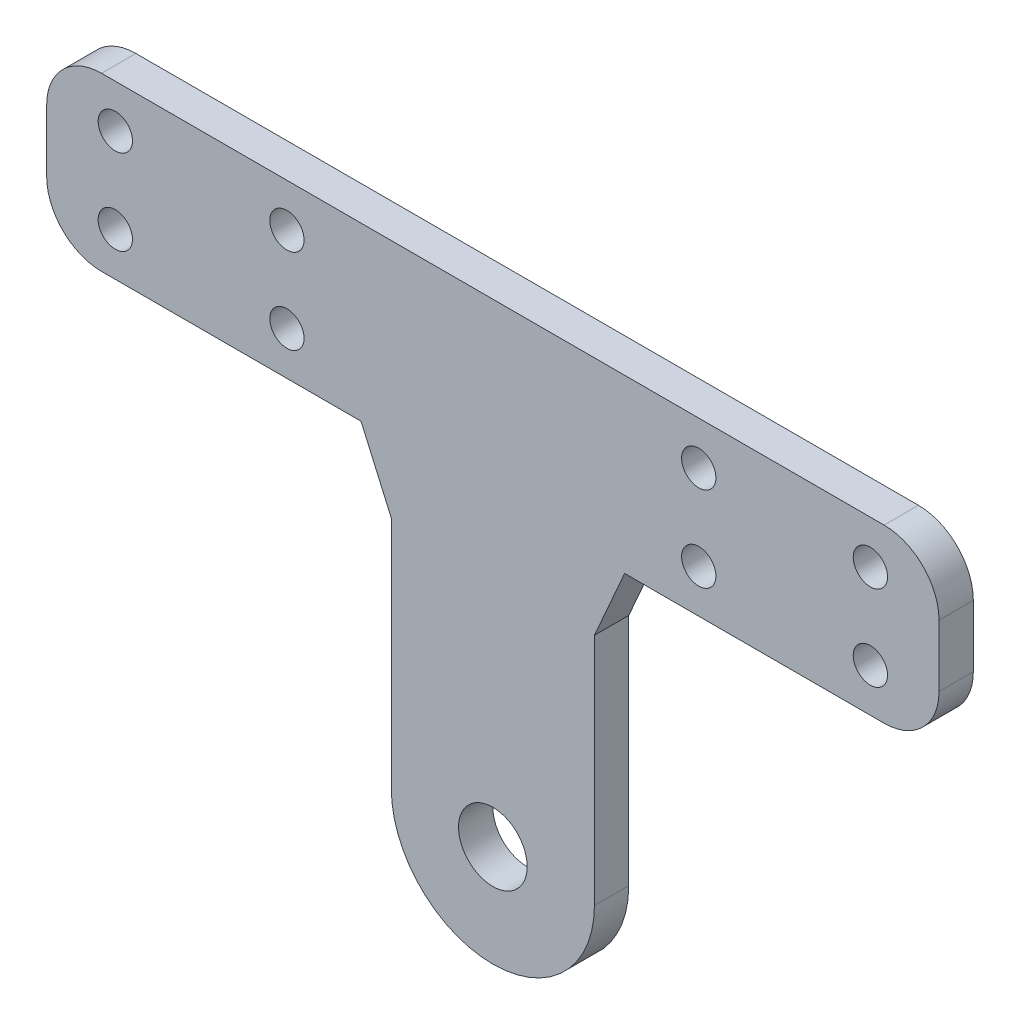
ISO-10303-21;
HEADER;
FILE_DESCRIPTION(('STEP AP214'),'2;1');
FILE_NAME('part.step','',(''),(''),'','','');
FILE_SCHEMA(('AUTOMOTIVE_DESIGN { 1 0 10303 214 1 1 1 1 }'));
ENDSEC;
DATA;
#1=APPLICATION_CONTEXT('core data for automotive mechanical design processes');
#2=APPLICATION_PROTOCOL_DEFINITION('international standard','automotive_design',2000,#1);
#3=PRODUCT_CONTEXT('',#1,'mechanical');
#4=PRODUCT('Part','Part','',(#3));
#5=PRODUCT_RELATED_PRODUCT_CATEGORY('part','',(#4));
#6=PRODUCT_DEFINITION_FORMATION('','',#4);
#7=PRODUCT_DEFINITION_CONTEXT('part definition',#1,'design');
#8=PRODUCT_DEFINITION('design','',#6,#7);
#9=PRODUCT_DEFINITION_SHAPE('','',#8);
#10=(LENGTH_UNIT() NAMED_UNIT(*) SI_UNIT(.MILLI.,.METRE.));
#11=(NAMED_UNIT(*) PLANE_ANGLE_UNIT() SI_UNIT($,.RADIAN.));
#12=(NAMED_UNIT(*) SI_UNIT($,.STERADIAN.) SOLID_ANGLE_UNIT());
#13=UNCERTAINTY_MEASURE_WITH_UNIT(LENGTH_MEASURE(1.E-05),#10,'distance_accuracy_value','');
#14=(GEOMETRIC_REPRESENTATION_CONTEXT(3) GLOBAL_UNCERTAINTY_ASSIGNED_CONTEXT((#13)) GLOBAL_UNIT_ASSIGNED_CONTEXT((#10,
#11,#12)) REPRESENTATION_CONTEXT('',''));
#15=CARTESIAN_POINT('',(0.,0.,0.));
#16=DIRECTION('',(0.,0.,1.));
#17=DIRECTION('',(1.,0.,0.));
#18=AXIS2_PLACEMENT_3D('',#15,#16,#17);
#19=CARTESIAN_POINT('',(0.,0.,3.175));
#20=DIRECTION('',(0.,0.,1.));
#21=DIRECTION('',(1.,0.,0.));
#22=AXIS2_PLACEMENT_3D('',#19,#20,#21);
#23=PLANE('',#22);
#24=CARTESIAN_POINT('',(-34.925,39.879,3.175));
#25=DIRECTION('',(0.,0.,1.));
#26=DIRECTION('',(1.,0.,0.));
#27=AXIS2_PLACEMENT_3D('',#24,#25,#26);
#28=CIRCLE('',#27,1.5875);
#29=CARTESIAN_POINT('',(-33.3375,39.879,3.175));
#30=VERTEX_POINT('',#29);
#31=EDGE_CURVE('E295',#30,#30,#28,.T.);
#32=ORIENTED_EDGE('',*,*,#31,.F.);
#33=EDGE_LOOP('',(#32));
#34=FACE_BOUND('',#33,.T.);
#35=CARTESIAN_POINT('',(-19.05,39.879,3.175));
#36=DIRECTION('',(0.,0.,1.));
#37=DIRECTION('',(1.,0.,0.));
#38=AXIS2_PLACEMENT_3D('',#35,#36,#37);
#39=CIRCLE('',#38,1.5875);
#40=CARTESIAN_POINT('',(-17.4625,39.879,3.175));
#41=VERTEX_POINT('',#40);
#42=EDGE_CURVE('E283',#41,#41,#39,.T.);
#43=ORIENTED_EDGE('',*,*,#42,.F.);
#44=EDGE_LOOP('',(#43));
#45=FACE_BOUND('',#44,.T.);
#46=CARTESIAN_POINT('',(34.925,32.004,3.175));
#47=DIRECTION('',(0.,0.,1.));
#48=DIRECTION('',(-1.,0.,0.));
#49=AXIS2_PLACEMENT_3D('',#46,#47,#48);
#50=CIRCLE('',#49,1.5875);
#51=CARTESIAN_POINT('',(33.3375,32.004,3.175));
#52=VERTEX_POINT('',#51);
#53=EDGE_CURVE('E271',#52,#52,#50,.T.);
#54=ORIENTED_EDGE('',*,*,#53,.F.);
#55=EDGE_LOOP('',(#54));
#56=FACE_BOUND('',#55,.T.);
#57=CARTESIAN_POINT('',(-19.05,32.004,3.175));
#58=DIRECTION('',(0.,0.,1.));
#59=DIRECTION('',(1.,0.,0.));
#60=AXIS2_PLACEMENT_3D('',#57,#58,#59);
#61=CIRCLE('',#60,1.5875);
#62=CARTESIAN_POINT('',(-17.4625,32.004,3.175));
#63=VERTEX_POINT('',#62);
#64=EDGE_CURVE('E259',#63,#63,#61,.T.);
#65=ORIENTED_EDGE('',*,*,#64,.F.);
#66=EDGE_LOOP('',(#65));
#67=FACE_BOUND('',#66,.T.);
#68=DIRECTION('',(1.,0.,0.));
#69=VECTOR('',#68,1.);
#70=CARTESIAN_POINT('',(12.192,28.004,3.175));
#71=LINE('',#70,#69);
#72=CARTESIAN_POINT('',(12.192,28.004,3.175));
#73=VERTEX_POINT('',#72);
#74=CARTESIAN_POINT('',(36.195,28.004,3.175));
#75=VERTEX_POINT('',#74);
#76=EDGE_CURVE('E172',#73,#75,#71,.T.);
#77=ORIENTED_EDGE('',*,*,#76,.T.);
#78=CARTESIAN_POINT('',(36.195,33.084,3.175));
#79=DIRECTION('',(0.,0.,1.));
#80=DIRECTION('',(1.,0.,0.));
#81=AXIS2_PLACEMENT_3D('',#78,#79,#80);
#82=CIRCLE('',#81,5.08);
#83=CARTESIAN_POINT('',(41.275,33.084,3.175));
#84=VERTEX_POINT('',#83);
#85=EDGE_CURVE('E232',#75,#84,#82,.T.);
#86=ORIENTED_EDGE('',*,*,#85,.T.);
#87=DIRECTION('',(0.,1.,0.));
#88=VECTOR('',#87,1.);
#89=CARTESIAN_POINT('',(41.275,43.879,3.175));
#90=LINE('',#89,#88);
#91=CARTESIAN_POINT('',(41.275,38.799,3.175));
#92=VERTEX_POINT('',#91);
#93=EDGE_CURVE('E174',#84,#92,#90,.T.);
#94=ORIENTED_EDGE('',*,*,#93,.T.);
#95=CARTESIAN_POINT('',(36.195,38.799,3.175));
#96=DIRECTION('',(0.,0.,1.));
#97=DIRECTION('',(1.,0.,0.));
#98=AXIS2_PLACEMENT_3D('',#95,#96,#97);
#99=CIRCLE('',#98,5.08);
#100=CARTESIAN_POINT('',(36.195,43.879,3.175));
#101=VERTEX_POINT('',#100);
#102=EDGE_CURVE('E55',#92,#101,#99,.T.);
#103=ORIENTED_EDGE('',*,*,#102,.T.);
#104=DIRECTION('',(-1.,0.,0.));
#105=VECTOR('',#104,1.);
#106=CARTESIAN_POINT('',(-41.275,43.879,3.175));
#107=LINE('',#106,#105);
#108=CARTESIAN_POINT('',(-36.195,43.879,3.175));
#109=VERTEX_POINT('',#108);
#110=EDGE_CURVE('E176',#101,#109,#107,.T.);
#111=ORIENTED_EDGE('',*,*,#110,.T.);
#112=CARTESIAN_POINT('',(-36.195,38.799,3.175));
#113=DIRECTION('',(0.,0.,1.));
#114=DIRECTION('',(1.,0.,0.));
#115=AXIS2_PLACEMENT_3D('',#112,#113,#114);
#116=CIRCLE('',#115,5.08);
#117=CARTESIAN_POINT('',(-41.275,38.799,3.175));
#118=VERTEX_POINT('',#117);
#119=EDGE_CURVE('E228',#109,#118,#116,.T.);
#120=ORIENTED_EDGE('',*,*,#119,.T.);
#121=DIRECTION('',(0.,-1.,0.));
#122=VECTOR('',#121,1.);
#123=CARTESIAN_POINT('',(-41.275,43.879,3.175));
#124=LINE('',#123,#122);
#125=CARTESIAN_POINT('',(-41.275,33.084,3.175));
#126=VERTEX_POINT('',#125);
#127=EDGE_CURVE('E146',#118,#126,#124,.T.);
#128=ORIENTED_EDGE('',*,*,#127,.T.);
#129=CARTESIAN_POINT('',(-36.195,33.084,3.175));
#130=DIRECTION('',(0.,0.,1.));
#131=DIRECTION('',(1.,0.,0.));
#132=AXIS2_PLACEMENT_3D('',#129,#130,#131);
#133=CIRCLE('',#132,5.08);
#134=CARTESIAN_POINT('',(-36.195,28.004,3.175));
#135=VERTEX_POINT('',#134);
#136=EDGE_CURVE('E142',#126,#135,#133,.T.);
#137=ORIENTED_EDGE('',*,*,#136,.T.);
#138=DIRECTION('',(1.,0.,0.));
#139=VECTOR('',#138,1.);
#140=CARTESIAN_POINT('',(-41.275,28.004,3.175));
#141=LINE('',#140,#139);
#142=CARTESIAN_POINT('',(-12.192,28.004,3.175));
#143=VERTEX_POINT('',#142);
#144=EDGE_CURVE('E133',#135,#143,#141,.T.);
#145=ORIENTED_EDGE('',*,*,#144,.T.);
#146=DIRECTION('',(0.402738614266017,-0.915315032422766,0.));
#147=VECTOR('',#146,1.);
#148=CARTESIAN_POINT('',(-12.192,28.004,3.175));
#149=LINE('',#148,#147);
#150=CARTESIAN_POINT('',(-9.398,21.654,3.175));
#151=VERTEX_POINT('',#150);
#152=EDGE_CURVE('E138',#143,#151,#149,.T.);
#153=ORIENTED_EDGE('',*,*,#152,.T.);
#154=DIRECTION('',(0.,-1.,0.));
#155=VECTOR('',#154,1.);
#156=CARTESIAN_POINT('',(-9.398,21.654,3.175));
#157=LINE('',#156,#155);
#158=CARTESIAN_POINT('',(-9.398,0.,3.175));
#159=VERTEX_POINT('',#158);
#160=EDGE_CURVE('E161',#151,#159,#157,.T.);
#161=ORIENTED_EDGE('',*,*,#160,.T.);
#162=CARTESIAN_POINT('',(0.,0.,3.175));
#163=DIRECTION('',(0.,0.,1.));
#164=DIRECTION('',(1.,0.,0.));
#165=AXIS2_PLACEMENT_3D('',#162,#163,#164);
#166=CIRCLE('',#165,9.398);
#167=CARTESIAN_POINT('',(9.398,0.,3.175));
#168=VERTEX_POINT('',#167);
#169=EDGE_CURVE('E163',#159,#168,#166,.T.);
#170=ORIENTED_EDGE('',*,*,#169,.T.);
#171=DIRECTION('',(0.,1.,0.));
#172=VECTOR('',#171,1.);
#173=CARTESIAN_POINT('',(9.398,0.,3.175));
#174=LINE('',#173,#172);
#175=CARTESIAN_POINT('',(9.398,21.654,3.175));
#176=VERTEX_POINT('',#175);
#177=EDGE_CURVE('E168',#168,#176,#174,.T.);
#178=ORIENTED_EDGE('',*,*,#177,.T.);
#179=DIRECTION('',(0.402738614266017,0.915315032422765,0.));
#180=VECTOR('',#179,1.);
#181=CARTESIAN_POINT('',(9.398,21.654,3.175));
#182=LINE('',#181,#180);
#183=EDGE_CURVE('E170',#176,#73,#182,.T.);
#184=ORIENTED_EDGE('',*,*,#183,.T.);
#185=EDGE_LOOP('',(#77,#86,#94,#103,#111,#120,#128,#137,#145,#153,#161,#170,#178,#184));
#186=FACE_BOUND('',#185,.T.);
#187=CARTESIAN_POINT('',(0.,0.,3.175));
#188=DIRECTION('',(0.,0.,1.));
#189=DIRECTION('',(1.,0.,0.));
#190=AXIS2_PLACEMENT_3D('',#187,#188,#189);
#191=CIRCLE('',#190,3.175);
#192=CARTESIAN_POINT('',(3.175,0.,3.175));
#193=VERTEX_POINT('',#192);
#194=EDGE_CURVE('E182',#193,#193,#191,.T.);
#195=ORIENTED_EDGE('',*,*,#194,.F.);
#196=EDGE_LOOP('',(#195));
#197=FACE_BOUND('',#196,.T.);
#198=CARTESIAN_POINT('',(-34.925,32.004,3.175));
#199=DIRECTION('',(0.,0.,1.));
#200=DIRECTION('',(1.,0.,0.));
#201=AXIS2_PLACEMENT_3D('',#198,#199,#200);
#202=CIRCLE('',#201,1.5875);
#203=CARTESIAN_POINT('',(-33.3375,32.004,3.175));
#204=VERTEX_POINT('',#203);
#205=EDGE_CURVE('E265',#204,#204,#202,.T.);
#206=ORIENTED_EDGE('',*,*,#205,.F.);
#207=EDGE_LOOP('',(#206));
#208=FACE_BOUND('',#207,.T.);
#209=CARTESIAN_POINT('',(19.05,32.004,3.175));
#210=DIRECTION('',(0.,0.,1.));
#211=DIRECTION('',(-1.,0.,0.));
#212=AXIS2_PLACEMENT_3D('',#209,#210,#211);
#213=CIRCLE('',#212,1.5875);
#214=CARTESIAN_POINT('',(17.4625,32.004,3.175));
#215=VERTEX_POINT('',#214);
#216=EDGE_CURVE('E277',#215,#215,#213,.T.);
#217=ORIENTED_EDGE('',*,*,#216,.F.);
#218=EDGE_LOOP('',(#217));
#219=FACE_BOUND('',#218,.T.);
#220=CARTESIAN_POINT('',(34.925,39.879,3.175));
#221=DIRECTION('',(0.,0.,1.));
#222=DIRECTION('',(-1.,0.,0.));
#223=AXIS2_PLACEMENT_3D('',#220,#221,#222);
#224=CIRCLE('',#223,1.5875);
#225=CARTESIAN_POINT('',(33.3375,39.879,3.175));
#226=VERTEX_POINT('',#225);
#227=EDGE_CURVE('E289',#226,#226,#224,.T.);
#228=ORIENTED_EDGE('',*,*,#227,.F.);
#229=EDGE_LOOP('',(#228));
#230=FACE_BOUND('',#229,.T.);
#231=CARTESIAN_POINT('',(19.05,39.879,3.175));
#232=DIRECTION('',(0.,0.,1.));
#233=DIRECTION('',(-1.,0.,0.));
#234=AXIS2_PLACEMENT_3D('',#231,#232,#233);
#235=CIRCLE('',#234,1.5875);
#236=CARTESIAN_POINT('',(17.4625,39.879,3.175));
#237=VERTEX_POINT('',#236);
#238=EDGE_CURVE('E301',#237,#237,#235,.T.);
#239=ORIENTED_EDGE('',*,*,#238,.F.);
#240=EDGE_LOOP('',(#239));
#241=FACE_BOUND('',#240,.T.);
#242=ADVANCED_FACE('F33',(#34,#45,#56,#67,#186,#197,#208,#219,#230,#241),#23,.T.);
#243=CARTESIAN_POINT('',(0.,0.,0.));
#244=DIRECTION('',(0.,0.,1.));
#245=DIRECTION('',(1.,0.,0.));
#246=AXIS2_PLACEMENT_3D('',#243,#244,#245);
#247=PLANE('',#246);
#248=DIRECTION('',(0.,1.,0.));
#249=VECTOR('',#248,1.);
#250=CARTESIAN_POINT('',(41.275,43.879,0.));
#251=LINE('',#250,#249);
#252=CARTESIAN_POINT('',(41.275,33.084,0.));
#253=VERTEX_POINT('',#252);
#254=CARTESIAN_POINT('',(41.275,38.799,0.));
#255=VERTEX_POINT('',#254);
#256=EDGE_CURVE('E197',#253,#255,#251,.T.);
#257=ORIENTED_EDGE('',*,*,#256,.F.);
#258=CARTESIAN_POINT('',(36.195,33.084,0.));
#259=DIRECTION('',(0.,0.,1.));
#260=DIRECTION('',(1.,0.,0.));
#261=AXIS2_PLACEMENT_3D('',#258,#259,#260);
#262=CIRCLE('',#261,5.08);
#263=CARTESIAN_POINT('',(36.195,28.004,0.));
#264=VERTEX_POINT('',#263);
#265=EDGE_CURVE('E224',#253,#264,#262,.F.);
#266=ORIENTED_EDGE('',*,*,#265,.T.);
#267=DIRECTION('',(1.,0.,0.));
#268=VECTOR('',#267,1.);
#269=CARTESIAN_POINT('',(12.192,28.004,0.));
#270=LINE('',#269,#268);
#271=CARTESIAN_POINT('',(12.192,28.004,0.));
#272=VERTEX_POINT('',#271);
#273=EDGE_CURVE('E194',#272,#264,#270,.T.);
#274=ORIENTED_EDGE('',*,*,#273,.F.);
#275=DIRECTION('',(0.402738614266017,0.915315032422765,0.));
#276=VECTOR('',#275,1.);
#277=CARTESIAN_POINT('',(9.398,21.654,0.));
#278=LINE('',#277,#276);
#279=CARTESIAN_POINT('',(9.398,21.654,0.));
#280=VERTEX_POINT('',#279);
#281=EDGE_CURVE('E192',#280,#272,#278,.T.);
#282=ORIENTED_EDGE('',*,*,#281,.F.);
#283=DIRECTION('',(0.,1.,0.));
#284=VECTOR('',#283,1.);
#285=CARTESIAN_POINT('',(9.398,0.,0.));
#286=LINE('',#285,#284);
#287=CARTESIAN_POINT('',(9.398,0.,0.));
#288=VERTEX_POINT('',#287);
#289=EDGE_CURVE('E190',#288,#280,#286,.T.);
#290=ORIENTED_EDGE('',*,*,#289,.F.);
#291=CARTESIAN_POINT('',(0.,0.,0.));
#292=DIRECTION('',(0.,0.,1.));
#293=DIRECTION('',(1.,0.,0.));
#294=AXIS2_PLACEMENT_3D('',#291,#292,#293);
#295=CIRCLE('',#294,9.398);
#296=CARTESIAN_POINT('',(-9.398,0.,0.));
#297=VERTEX_POINT('',#296);
#298=EDGE_CURVE('E188',#297,#288,#295,.T.);
#299=ORIENTED_EDGE('',*,*,#298,.F.);
#300=DIRECTION('',(0.,-1.,0.));
#301=VECTOR('',#300,1.);
#302=CARTESIAN_POINT('',(-9.398,21.654,0.));
#303=LINE('',#302,#301);
#304=CARTESIAN_POINT('',(-9.398,21.654,0.));
#305=VERTEX_POINT('',#304);
#306=EDGE_CURVE('E186',#305,#297,#303,.T.);
#307=ORIENTED_EDGE('',*,*,#306,.F.);
#308=DIRECTION('',(0.402738614266017,-0.915315032422766,0.));
#309=VECTOR('',#308,1.);
#310=CARTESIAN_POINT('',(-12.192,28.004,0.));
#311=LINE('',#310,#309);
#312=CARTESIAN_POINT('',(-12.192,28.004,0.));
#313=VERTEX_POINT('',#312);
#314=EDGE_CURVE('E184',#313,#305,#311,.T.);
#315=ORIENTED_EDGE('',*,*,#314,.F.);
#316=DIRECTION('',(1.,0.,0.));
#317=VECTOR('',#316,1.);
#318=CARTESIAN_POINT('',(-41.275,28.004,0.));
#319=LINE('',#318,#317);
#320=CARTESIAN_POINT('',(-36.195,28.004,0.));
#321=VERTEX_POINT('',#320);
#322=EDGE_CURVE('E152',#321,#313,#319,.T.);
#323=ORIENTED_EDGE('',*,*,#322,.F.);
#324=CARTESIAN_POINT('',(-36.195,33.084,0.));
#325=DIRECTION('',(0.,0.,1.));
#326=DIRECTION('',(1.,0.,0.));
#327=AXIS2_PLACEMENT_3D('',#324,#325,#326);
#328=CIRCLE('',#327,5.08);
#329=CARTESIAN_POINT('',(-41.275,33.084,0.));
#330=VERTEX_POINT('',#329);
#331=EDGE_CURVE('E220',#321,#330,#328,.F.);
#332=ORIENTED_EDGE('',*,*,#331,.T.);
#333=DIRECTION('',(0.,-1.,0.));
#334=VECTOR('',#333,1.);
#335=CARTESIAN_POINT('',(-41.275,43.879,0.));
#336=LINE('',#335,#334);
#337=CARTESIAN_POINT('',(-41.275,38.799,0.));
#338=VERTEX_POINT('',#337);
#339=EDGE_CURVE('E179',#338,#330,#336,.T.);
#340=ORIENTED_EDGE('',*,*,#339,.F.);
#341=CARTESIAN_POINT('',(-36.195,38.799,0.));
#342=DIRECTION('',(0.,0.,1.));
#343=DIRECTION('',(1.,0.,0.));
#344=AXIS2_PLACEMENT_3D('',#341,#342,#343);
#345=CIRCLE('',#344,5.08);
#346=CARTESIAN_POINT('',(-36.195,43.879,0.));
#347=VERTEX_POINT('',#346);
#348=EDGE_CURVE('E218',#338,#347,#345,.F.);
#349=ORIENTED_EDGE('',*,*,#348,.T.);
#350=DIRECTION('',(-1.,0.,0.));
#351=VECTOR('',#350,1.);
#352=CARTESIAN_POINT('',(-41.275,43.879,0.));
#353=LINE('',#352,#351);
#354=CARTESIAN_POINT('',(36.195,43.879,0.));
#355=VERTEX_POINT('',#354);
#356=EDGE_CURVE('E200',#355,#347,#353,.T.);
#357=ORIENTED_EDGE('',*,*,#356,.F.);
#358=CARTESIAN_POINT('',(36.195,38.799,0.));
#359=DIRECTION('',(0.,0.,1.));
#360=DIRECTION('',(1.,0.,0.));
#361=AXIS2_PLACEMENT_3D('',#358,#359,#360);
#362=CIRCLE('',#361,5.08);
#363=EDGE_CURVE('E222',#355,#255,#362,.F.);
#364=ORIENTED_EDGE('',*,*,#363,.T.);
#365=EDGE_LOOP('',(#257,#266,#274,#282,#290,#299,#307,#315,#323,#332,#340,#349,#357,#364));
#366=FACE_BOUND('',#365,.T.);
#367=CARTESIAN_POINT('',(0.,0.,0.));
#368=DIRECTION('',(0.,0.,1.));
#369=DIRECTION('',(1.,0.,0.));
#370=AXIS2_PLACEMENT_3D('',#367,#368,#369);
#371=CIRCLE('',#370,3.175);
#372=CARTESIAN_POINT('',(3.175,0.,0.));
#373=VERTEX_POINT('',#372);
#374=EDGE_CURVE('E256',#373,#373,#371,.T.);
#375=ORIENTED_EDGE('',*,*,#374,.T.);
#376=EDGE_LOOP('',(#375));
#377=FACE_BOUND('',#376,.T.);
#378=CARTESIAN_POINT('',(-19.05,32.004,0.));
#379=DIRECTION('',(0.,0.,1.));
#380=DIRECTION('',(1.,0.,0.));
#381=AXIS2_PLACEMENT_3D('',#378,#379,#380);
#382=CIRCLE('',#381,1.5875);
#383=CARTESIAN_POINT('',(-17.4625,32.004,0.));
#384=VERTEX_POINT('',#383);
#385=EDGE_CURVE('E262',#384,#384,#382,.T.);
#386=ORIENTED_EDGE('',*,*,#385,.T.);
#387=EDGE_LOOP('',(#386));
#388=FACE_BOUND('',#387,.T.);
#389=CARTESIAN_POINT('',(-34.925,32.004,0.));
#390=DIRECTION('',(0.,0.,1.));
#391=DIRECTION('',(1.,0.,0.));
#392=AXIS2_PLACEMENT_3D('',#389,#390,#391);
#393=CIRCLE('',#392,1.5875);
#394=CARTESIAN_POINT('',(-33.3375,32.004,0.));
#395=VERTEX_POINT('',#394);
#396=EDGE_CURVE('E268',#395,#395,#393,.T.);
#397=ORIENTED_EDGE('',*,*,#396,.T.);
#398=EDGE_LOOP('',(#397));
#399=FACE_BOUND('',#398,.T.);
#400=CARTESIAN_POINT('',(34.925,32.004,0.));
#401=DIRECTION('',(0.,0.,1.));
#402=DIRECTION('',(-1.,0.,0.));
#403=AXIS2_PLACEMENT_3D('',#400,#401,#402);
#404=CIRCLE('',#403,1.5875);
#405=CARTESIAN_POINT('',(33.3375,32.004,0.));
#406=VERTEX_POINT('',#405);
#407=EDGE_CURVE('E274',#406,#406,#404,.T.);
#408=ORIENTED_EDGE('',*,*,#407,.T.);
#409=EDGE_LOOP('',(#408));
#410=FACE_BOUND('',#409,.T.);
#411=CARTESIAN_POINT('',(19.05,32.004,0.));
#412=DIRECTION('',(0.,0.,1.));
#413=DIRECTION('',(-1.,0.,0.));
#414=AXIS2_PLACEMENT_3D('',#411,#412,#413);
#415=CIRCLE('',#414,1.5875);
#416=CARTESIAN_POINT('',(17.4625,32.004,0.));
#417=VERTEX_POINT('',#416);
#418=EDGE_CURVE('E280',#417,#417,#415,.T.);
#419=ORIENTED_EDGE('',*,*,#418,.T.);
#420=EDGE_LOOP('',(#419));
#421=FACE_BOUND('',#420,.T.);
#422=CARTESIAN_POINT('',(-19.05,39.879,0.));
#423=DIRECTION('',(0.,0.,1.));
#424=DIRECTION('',(1.,0.,0.));
#425=AXIS2_PLACEMENT_3D('',#422,#423,#424);
#426=CIRCLE('',#425,1.5875);
#427=CARTESIAN_POINT('',(-17.4625,39.879,0.));
#428=VERTEX_POINT('',#427);
#429=EDGE_CURVE('E286',#428,#428,#426,.T.);
#430=ORIENTED_EDGE('',*,*,#429,.T.);
#431=EDGE_LOOP('',(#430));
#432=FACE_BOUND('',#431,.T.);
#433=CARTESIAN_POINT('',(34.925,39.879,0.));
#434=DIRECTION('',(0.,0.,1.));
#435=DIRECTION('',(-1.,0.,0.));
#436=AXIS2_PLACEMENT_3D('',#433,#434,#435);
#437=CIRCLE('',#436,1.5875);
#438=CARTESIAN_POINT('',(33.3375,39.879,0.));
#439=VERTEX_POINT('',#438);
#440=EDGE_CURVE('E292',#439,#439,#437,.T.);
#441=ORIENTED_EDGE('',*,*,#440,.T.);
#442=EDGE_LOOP('',(#441));
#443=FACE_BOUND('',#442,.T.);
#444=CARTESIAN_POINT('',(-34.925,39.879,0.));
#445=DIRECTION('',(0.,0.,1.));
#446=DIRECTION('',(1.,0.,0.));
#447=AXIS2_PLACEMENT_3D('',#444,#445,#446);
#448=CIRCLE('',#447,1.5875);
#449=CARTESIAN_POINT('',(-33.3375,39.879,0.));
#450=VERTEX_POINT('',#449);
#451=EDGE_CURVE('E298',#450,#450,#448,.T.);
#452=ORIENTED_EDGE('',*,*,#451,.T.);
#453=EDGE_LOOP('',(#452));
#454=FACE_BOUND('',#453,.T.);
#455=CARTESIAN_POINT('',(19.05,39.879,0.));
#456=DIRECTION('',(0.,0.,1.));
#457=DIRECTION('',(-1.,0.,0.));
#458=AXIS2_PLACEMENT_3D('',#455,#456,#457);
#459=CIRCLE('',#458,1.5875);
#460=CARTESIAN_POINT('',(17.4625,39.879,0.));
#461=VERTEX_POINT('',#460);
#462=EDGE_CURVE('E304',#461,#461,#459,.T.);
#463=ORIENTED_EDGE('',*,*,#462,.T.);
#464=EDGE_LOOP('',(#463));
#465=FACE_BOUND('',#464,.T.);
#466=ADVANCED_FACE('F250',(#366,#377,#388,#399,#410,#421,#432,#443,#454,#465),#247,.F.);
#467=CARTESIAN_POINT('',(-41.275,43.879,3.175));
#468=DIRECTION('',(1.,0.,0.));
#469=DIRECTION('',(0.,0.,-1.));
#470=AXIS2_PLACEMENT_3D('',#467,#468,#469);
#471=PLANE('',#470);
#472=ORIENTED_EDGE('',*,*,#339,.T.);
#473=DIRECTION('',(0.,0.,-1.));
#474=VECTOR('',#473,1.);
#475=CARTESIAN_POINT('',(-41.275,33.084,3.175));
#476=LINE('',#475,#474);
#477=EDGE_CURVE('E11',#330,#126,#476,.F.);
#478=ORIENTED_EDGE('',*,*,#477,.T.);
#479=ORIENTED_EDGE('',*,*,#127,.F.);
#480=DIRECTION('',(0.,0.,-1.));
#481=VECTOR('',#480,1.);
#482=CARTESIAN_POINT('',(-41.275,38.799,3.175));
#483=LINE('',#482,#481);
#484=EDGE_CURVE('E41',#118,#338,#483,.T.);
#485=ORIENTED_EDGE('',*,*,#484,.T.);
#486=EDGE_LOOP('',(#472,#478,#479,#485));
#487=FACE_BOUND('',#486,.T.);
#488=ADVANCED_FACE('F244',(#487),#471,.F.);
#489=CARTESIAN_POINT('',(-41.275,28.004,3.175));
#490=DIRECTION('',(0.,1.,0.));
#491=DIRECTION('',(-1.,0.,0.));
#492=AXIS2_PLACEMENT_3D('',#489,#490,#491);
#493=PLANE('',#492);
#494=ORIENTED_EDGE('',*,*,#144,.F.);
#495=DIRECTION('',(0.,0.,-1.));
#496=VECTOR('',#495,1.);
#497=CARTESIAN_POINT('',(-36.195,28.004,3.175));
#498=LINE('',#497,#496);
#499=EDGE_CURVE('E238',#135,#321,#498,.T.);
#500=ORIENTED_EDGE('',*,*,#499,.T.);
#501=ORIENTED_EDGE('',*,*,#322,.T.);
#502=DIRECTION('',(0.,0.,-1.));
#503=VECTOR('',#502,1.);
#504=CARTESIAN_POINT('',(-12.192,28.004,3.175));
#505=LINE('',#504,#503);
#506=EDGE_CURVE('E149',#143,#313,#505,.T.);
#507=ORIENTED_EDGE('',*,*,#506,.F.);
#508=EDGE_LOOP('',(#494,#500,#501,#507));
#509=FACE_BOUND('',#508,.T.);
#510=ADVANCED_FACE('F150',(#509),#493,.F.);
#511=CARTESIAN_POINT('',(-12.192,28.004,3.175));
#512=DIRECTION('',(0.915315032422766,0.402738614266017,0.));
#513=DIRECTION('',(-0.402738614266017,0.915315032422766,0.));
#514=AXIS2_PLACEMENT_3D('',#511,#512,#513);
#515=PLANE('',#514);
#516=ORIENTED_EDGE('',*,*,#314,.T.);
#517=DIRECTION('',(0.,0.,-1.));
#518=VECTOR('',#517,1.);
#519=CARTESIAN_POINT('',(-9.398,21.654,3.175));
#520=LINE('',#519,#518);
#521=EDGE_CURVE('E156',#151,#305,#520,.T.);
#522=ORIENTED_EDGE('',*,*,#521,.F.);
#523=ORIENTED_EDGE('',*,*,#152,.F.);
#524=ORIENTED_EDGE('',*,*,#506,.T.);
#525=EDGE_LOOP('',(#516,#522,#523,#524));
#526=FACE_BOUND('',#525,.T.);
#527=ADVANCED_FACE('F158',(#526),#515,.F.);
#528=CARTESIAN_POINT('',(-9.398,21.654,3.175));
#529=DIRECTION('',(1.,0.,0.));
#530=DIRECTION('',(0.,1.,0.));
#531=AXIS2_PLACEMENT_3D('',#528,#529,#530);
#532=PLANE('',#531);
#533=ORIENTED_EDGE('',*,*,#306,.T.);
#534=DIRECTION('',(0.,0.,-1.));
#535=VECTOR('',#534,1.);
#536=CARTESIAN_POINT('',(-9.398,0.,3.175));
#537=LINE('',#536,#535);
#538=EDGE_CURVE('E210',#159,#297,#537,.T.);
#539=ORIENTED_EDGE('',*,*,#538,.F.);
#540=ORIENTED_EDGE('',*,*,#160,.F.);
#541=ORIENTED_EDGE('',*,*,#521,.T.);
#542=EDGE_LOOP('',(#533,#539,#540,#541));
#543=FACE_BOUND('',#542,.T.);
#544=ADVANCED_FACE('F348',(#543),#532,.F.);
#545=CARTESIAN_POINT('',(0.,0.,3.175));
#546=DIRECTION('',(0.,0.,-1.));
#547=DIRECTION('',(-1.,0.,0.));
#548=AXIS2_PLACEMENT_3D('',#545,#546,#547);
#549=CYLINDRICAL_SURFACE('',#548,9.398);
#550=ORIENTED_EDGE('',*,*,#298,.T.);
#551=DIRECTION('',(0.,0.,-1.));
#552=VECTOR('',#551,1.);
#553=CARTESIAN_POINT('',(9.398,0.,3.175));
#554=LINE('',#553,#552);
#555=EDGE_CURVE('E207',#168,#288,#554,.T.);
#556=ORIENTED_EDGE('',*,*,#555,.F.);
#557=ORIENTED_EDGE('',*,*,#169,.F.);
#558=ORIENTED_EDGE('',*,*,#538,.T.);
#559=EDGE_LOOP('',(#550,#556,#557,#558));
#560=FACE_BOUND('',#559,.T.);
#561=ADVANCED_FACE('F344',(#560),#549,.T.);
#562=CARTESIAN_POINT('',(9.398,0.,3.175));
#563=DIRECTION('',(-1.,0.,0.));
#564=DIRECTION('',(0.,0.,1.));
#565=AXIS2_PLACEMENT_3D('',#562,#563,#564);
#566=PLANE('',#565);
#567=ORIENTED_EDGE('',*,*,#289,.T.);
#568=DIRECTION('',(0.,0.,-1.));
#569=VECTOR('',#568,1.);
#570=CARTESIAN_POINT('',(9.398,21.654,3.175));
#571=LINE('',#570,#569);
#572=EDGE_CURVE('E204',#176,#280,#571,.T.);
#573=ORIENTED_EDGE('',*,*,#572,.F.);
#574=ORIENTED_EDGE('',*,*,#177,.F.);
#575=ORIENTED_EDGE('',*,*,#555,.T.);
#576=EDGE_LOOP('',(#567,#573,#574,#575));
#577=FACE_BOUND('',#576,.T.);
#578=ADVANCED_FACE('F340',(#577),#566,.F.);
#579=CARTESIAN_POINT('',(9.398,21.654,3.175));
#580=DIRECTION('',(-0.915315032422765,0.402738614266017,0.));
#581=DIRECTION('',(-0.402738614266017,-0.915315032422766,0.));
#582=AXIS2_PLACEMENT_3D('',#579,#580,#581);
#583=PLANE('',#582);
#584=ORIENTED_EDGE('',*,*,#281,.T.);
#585=DIRECTION('',(0.,0.,-1.));
#586=VECTOR('',#585,1.);
#587=CARTESIAN_POINT('',(12.192,28.004,3.175));
#588=LINE('',#587,#586);
#589=EDGE_CURVE('E178',#73,#272,#588,.T.);
#590=ORIENTED_EDGE('',*,*,#589,.F.);
#591=ORIENTED_EDGE('',*,*,#183,.F.);
#592=ORIENTED_EDGE('',*,*,#572,.T.);
#593=EDGE_LOOP('',(#584,#590,#591,#592));
#594=FACE_BOUND('',#593,.T.);
#595=ADVANCED_FACE('F336',(#594),#583,.F.);
#596=CARTESIAN_POINT('',(12.192,28.004,3.175));
#597=DIRECTION('',(0.,1.,0.));
#598=DIRECTION('',(-1.,0.,0.));
#599=AXIS2_PLACEMENT_3D('',#596,#597,#598);
#600=PLANE('',#599);
#601=ORIENTED_EDGE('',*,*,#273,.T.);
#602=DIRECTION('',(0.,0.,-1.));
#603=VECTOR('',#602,1.);
#604=CARTESIAN_POINT('',(36.195,28.004,3.175));
#605=LINE('',#604,#603);
#606=EDGE_CURVE('E226',#264,#75,#605,.F.);
#607=ORIENTED_EDGE('',*,*,#606,.T.);
#608=ORIENTED_EDGE('',*,*,#76,.F.);
#609=ORIENTED_EDGE('',*,*,#589,.T.);
#610=EDGE_LOOP('',(#601,#607,#608,#609));
#611=FACE_BOUND('',#610,.T.);
#612=ADVANCED_FACE('F332',(#611),#600,.F.);
#613=CARTESIAN_POINT('',(41.275,43.879,3.175));
#614=DIRECTION('',(-1.,0.,0.));
#615=DIRECTION('',(0.,0.,1.));
#616=AXIS2_PLACEMENT_3D('',#613,#614,#615);
#617=PLANE('',#616);
#618=ORIENTED_EDGE('',*,*,#93,.F.);
#619=DIRECTION('',(0.,0.,-1.));
#620=VECTOR('',#619,1.);
#621=CARTESIAN_POINT('',(41.275,33.084,3.175));
#622=LINE('',#621,#620);
#623=EDGE_CURVE('E215',#84,#253,#622,.T.);
#624=ORIENTED_EDGE('',*,*,#623,.T.);
#625=ORIENTED_EDGE('',*,*,#256,.T.);
#626=DIRECTION('',(0.,0.,-1.));
#627=VECTOR('',#626,1.);
#628=CARTESIAN_POINT('',(41.275,38.799,3.175));
#629=LINE('',#628,#627);
#630=EDGE_CURVE('E155',#255,#92,#629,.F.);
#631=ORIENTED_EDGE('',*,*,#630,.T.);
#632=EDGE_LOOP('',(#618,#624,#625,#631));
#633=FACE_BOUND('',#632,.T.);
#634=ADVANCED_FACE('F329',(#633),#617,.F.);
#635=CARTESIAN_POINT('',(-41.275,43.879,3.175));
#636=DIRECTION('',(0.,-1.,0.));
#637=DIRECTION('',(0.,0.,-1.));
#638=AXIS2_PLACEMENT_3D('',#635,#636,#637);
#639=PLANE('',#638);
#640=ORIENTED_EDGE('',*,*,#110,.F.);
#641=DIRECTION('',(0.,0.,-1.));
#642=VECTOR('',#641,1.);
#643=CARTESIAN_POINT('',(36.195,43.879,3.175));
#644=LINE('',#643,#642);
#645=EDGE_CURVE('E235',#101,#355,#644,.T.);
#646=ORIENTED_EDGE('',*,*,#645,.T.);
#647=ORIENTED_EDGE('',*,*,#356,.T.);
#648=DIRECTION('',(0.,0.,-1.));
#649=VECTOR('',#648,1.);
#650=CARTESIAN_POINT('',(-36.195,43.879,3.175));
#651=LINE('',#650,#649);
#652=EDGE_CURVE('E48',#347,#109,#651,.F.);
#653=ORIENTED_EDGE('',*,*,#652,.T.);
#654=EDGE_LOOP('',(#640,#646,#647,#653));
#655=FACE_BOUND('',#654,.T.);
#656=ADVANCED_FACE('F326',(#655),#639,.F.);
#657=CARTESIAN_POINT('',(0.,0.,3.175));
#658=DIRECTION('',(0.,0.,-1.));
#659=DIRECTION('',(-1.,0.,0.));
#660=AXIS2_PLACEMENT_3D('',#657,#658,#659);
#661=CYLINDRICAL_SURFACE('',#660,3.175);
#662=ORIENTED_EDGE('',*,*,#194,.T.);
#663=EDGE_LOOP('',(#662));
#664=FACE_BOUND('',#663,.T.);
#665=ORIENTED_EDGE('',*,*,#374,.F.);
#666=EDGE_LOOP('',(#665));
#667=FACE_BOUND('',#666,.T.);
#668=ADVANCED_FACE('F323',(#664,#667),#661,.F.);
#669=CARTESIAN_POINT('',(-19.05,32.004,3.175));
#670=DIRECTION('',(0.,0.,-1.));
#671=DIRECTION('',(-1.,0.,0.));
#672=AXIS2_PLACEMENT_3D('',#669,#670,#671);
#673=CYLINDRICAL_SURFACE('',#672,1.5875);
#674=ORIENTED_EDGE('',*,*,#64,.T.);
#675=EDGE_LOOP('',(#674));
#676=FACE_BOUND('',#675,.T.);
#677=ORIENTED_EDGE('',*,*,#385,.F.);
#678=EDGE_LOOP('',(#677));
#679=FACE_BOUND('',#678,.T.);
#680=ADVANCED_FACE('F500',(#676,#679),#673,.F.);
#681=CARTESIAN_POINT('',(-34.925,32.004,3.175));
#682=DIRECTION('',(0.,0.,-1.));
#683=DIRECTION('',(-1.,0.,0.));
#684=AXIS2_PLACEMENT_3D('',#681,#682,#683);
#685=CYLINDRICAL_SURFACE('',#684,1.5875);
#686=ORIENTED_EDGE('',*,*,#205,.T.);
#687=EDGE_LOOP('',(#686));
#688=FACE_BOUND('',#687,.T.);
#689=ORIENTED_EDGE('',*,*,#396,.F.);
#690=EDGE_LOOP('',(#689));
#691=FACE_BOUND('',#690,.T.);
#692=ADVANCED_FACE('F490',(#688,#691),#685,.F.);
#693=CARTESIAN_POINT('',(34.925,32.004,3.175));
#694=DIRECTION('',(0.,0.,-1.));
#695=DIRECTION('',(-1.,0.,0.));
#696=AXIS2_PLACEMENT_3D('',#693,#694,#695);
#697=CYLINDRICAL_SURFACE('',#696,1.5875);
#698=ORIENTED_EDGE('',*,*,#53,.T.);
#699=EDGE_LOOP('',(#698));
#700=FACE_BOUND('',#699,.T.);
#701=ORIENTED_EDGE('',*,*,#407,.F.);
#702=EDGE_LOOP('',(#701));
#703=FACE_BOUND('',#702,.T.);
#704=ADVANCED_FACE('F480',(#700,#703),#697,.F.);
#705=CARTESIAN_POINT('',(19.05,32.004,3.175));
#706=DIRECTION('',(0.,0.,-1.));
#707=DIRECTION('',(-1.,0.,0.));
#708=AXIS2_PLACEMENT_3D('',#705,#706,#707);
#709=CYLINDRICAL_SURFACE('',#708,1.5875);
#710=ORIENTED_EDGE('',*,*,#216,.T.);
#711=EDGE_LOOP('',(#710));
#712=FACE_BOUND('',#711,.T.);
#713=ORIENTED_EDGE('',*,*,#418,.F.);
#714=EDGE_LOOP('',(#713));
#715=FACE_BOUND('',#714,.T.);
#716=ADVANCED_FACE('F470',(#712,#715),#709,.F.);
#717=CARTESIAN_POINT('',(-19.05,39.879,3.175));
#718=DIRECTION('',(0.,0.,-1.));
#719=DIRECTION('',(-1.,0.,0.));
#720=AXIS2_PLACEMENT_3D('',#717,#718,#719);
#721=CYLINDRICAL_SURFACE('',#720,1.5875);
#722=ORIENTED_EDGE('',*,*,#42,.T.);
#723=EDGE_LOOP('',(#722));
#724=FACE_BOUND('',#723,.T.);
#725=ORIENTED_EDGE('',*,*,#429,.F.);
#726=EDGE_LOOP('',(#725));
#727=FACE_BOUND('',#726,.T.);
#728=ADVANCED_FACE('F460',(#724,#727),#721,.F.);
#729=CARTESIAN_POINT('',(34.925,39.879,3.175));
#730=DIRECTION('',(0.,0.,-1.));
#731=DIRECTION('',(-1.,0.,0.));
#732=AXIS2_PLACEMENT_3D('',#729,#730,#731);
#733=CYLINDRICAL_SURFACE('',#732,1.5875);
#734=ORIENTED_EDGE('',*,*,#227,.T.);
#735=EDGE_LOOP('',(#734));
#736=FACE_BOUND('',#735,.T.);
#737=ORIENTED_EDGE('',*,*,#440,.F.);
#738=EDGE_LOOP('',(#737));
#739=FACE_BOUND('',#738,.T.);
#740=ADVANCED_FACE('F450',(#736,#739),#733,.F.);
#741=CARTESIAN_POINT('',(-34.925,39.879,3.175));
#742=DIRECTION('',(0.,0.,-1.));
#743=DIRECTION('',(-1.,0.,0.));
#744=AXIS2_PLACEMENT_3D('',#741,#742,#743);
#745=CYLINDRICAL_SURFACE('',#744,1.5875);
#746=ORIENTED_EDGE('',*,*,#31,.T.);
#747=EDGE_LOOP('',(#746));
#748=FACE_BOUND('',#747,.T.);
#749=ORIENTED_EDGE('',*,*,#451,.F.);
#750=EDGE_LOOP('',(#749));
#751=FACE_BOUND('',#750,.T.);
#752=ADVANCED_FACE('F441',(#748,#751),#745,.F.);
#753=CARTESIAN_POINT('',(19.05,39.879,3.175));
#754=DIRECTION('',(0.,0.,-1.));
#755=DIRECTION('',(-1.,0.,0.));
#756=AXIS2_PLACEMENT_3D('',#753,#754,#755);
#757=CYLINDRICAL_SURFACE('',#756,1.5875);
#758=ORIENTED_EDGE('',*,*,#238,.T.);
#759=EDGE_LOOP('',(#758));
#760=FACE_BOUND('',#759,.T.);
#761=ORIENTED_EDGE('',*,*,#462,.F.);
#762=EDGE_LOOP('',(#761));
#763=FACE_BOUND('',#762,.T.);
#764=ADVANCED_FACE('F310',(#760,#763),#757,.F.);
#765=CARTESIAN_POINT('',(36.195,33.084,3.175));
#766=DIRECTION('',(0.,0.,-1.));
#767=DIRECTION('',(-1.,0.,0.));
#768=AXIS2_PLACEMENT_3D('',#765,#766,#767);
#769=CYLINDRICAL_SURFACE('',#768,5.08);
#770=ORIENTED_EDGE('',*,*,#85,.F.);
#771=ORIENTED_EDGE('',*,*,#606,.F.);
#772=ORIENTED_EDGE('',*,*,#265,.F.);
#773=ORIENTED_EDGE('',*,*,#623,.F.);
#774=EDGE_LOOP('',(#770,#771,#772,#773));
#775=FACE_BOUND('',#774,.T.);
#776=ADVANCED_FACE('F359',(#775),#769,.T.);
#777=CARTESIAN_POINT('',(36.195,38.799,3.175));
#778=DIRECTION('',(0.,0.,-1.));
#779=DIRECTION('',(-1.,0.,0.));
#780=AXIS2_PLACEMENT_3D('',#777,#778,#779);
#781=CYLINDRICAL_SURFACE('',#780,5.08);
#782=ORIENTED_EDGE('',*,*,#102,.F.);
#783=ORIENTED_EDGE('',*,*,#630,.F.);
#784=ORIENTED_EDGE('',*,*,#363,.F.);
#785=ORIENTED_EDGE('',*,*,#645,.F.);
#786=EDGE_LOOP('',(#782,#783,#784,#785));
#787=FACE_BOUND('',#786,.T.);
#788=ADVANCED_FACE('F362',(#787),#781,.T.);
#789=CARTESIAN_POINT('',(-36.195,33.084,3.175));
#790=DIRECTION('',(0.,0.,-1.));
#791=DIRECTION('',(-1.,0.,0.));
#792=AXIS2_PLACEMENT_3D('',#789,#790,#791);
#793=CYLINDRICAL_SURFACE('',#792,5.08);
#794=ORIENTED_EDGE('',*,*,#136,.F.);
#795=ORIENTED_EDGE('',*,*,#477,.F.);
#796=ORIENTED_EDGE('',*,*,#331,.F.);
#797=ORIENTED_EDGE('',*,*,#499,.F.);
#798=EDGE_LOOP('',(#794,#795,#796,#797));
#799=FACE_BOUND('',#798,.T.);
#800=ADVANCED_FACE('F254',(#799),#793,.T.);
#801=CARTESIAN_POINT('',(-36.195,38.799,3.175));
#802=DIRECTION('',(0.,0.,-1.));
#803=DIRECTION('',(-1.,0.,0.));
#804=AXIS2_PLACEMENT_3D('',#801,#802,#803);
#805=CYLINDRICAL_SURFACE('',#804,5.08);
#806=ORIENTED_EDGE('',*,*,#119,.F.);
#807=ORIENTED_EDGE('',*,*,#652,.F.);
#808=ORIENTED_EDGE('',*,*,#348,.F.);
#809=ORIENTED_EDGE('',*,*,#484,.F.);
#810=EDGE_LOOP('',(#806,#807,#808,#809));
#811=FACE_BOUND('',#810,.T.);
#812=ADVANCED_FACE('F35',(#811),#805,.T.);
#813=CLOSED_SHELL('',(#242,#466,#488,#510,#527,#544,#561,#578,#595,#612,#634,#656,#668,#680,
#692,#704,#716,#728,#740,#752,#764,#776,#788,#800,#812));
#814=MANIFOLD_SOLID_BREP('B2',#813);
#815=ADVANCED_BREP_SHAPE_REPRESENTATION('',(#18,#814),#14);
#816=SHAPE_DEFINITION_REPRESENTATION(#9,#815);
ENDSEC;
END-ISO-10303-21;
